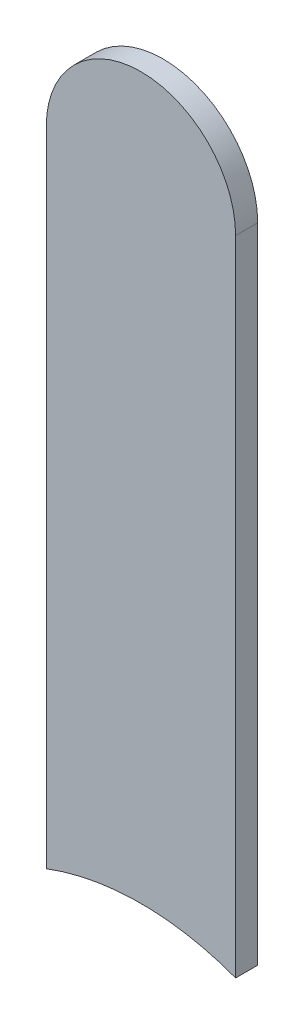
ISO-10303-21;
HEADER;
FILE_DESCRIPTION(('STEP AP214'),'2;1');
FILE_NAME('part.step','',(''),(''),'','','');
FILE_SCHEMA(('AUTOMOTIVE_DESIGN { 1 0 10303 214 1 1 1 1 }'));
ENDSEC;
DATA;
#1=APPLICATION_CONTEXT('core data for automotive mechanical design processes');
#2=APPLICATION_PROTOCOL_DEFINITION('international standard','automotive_design',2000,#1);
#3=PRODUCT_CONTEXT('',#1,'mechanical');
#4=PRODUCT('Part','Part','',(#3));
#5=PRODUCT_RELATED_PRODUCT_CATEGORY('part','',(#4));
#6=PRODUCT_DEFINITION_FORMATION('','',#4);
#7=PRODUCT_DEFINITION_CONTEXT('part definition',#1,'design');
#8=PRODUCT_DEFINITION('design','',#6,#7);
#9=PRODUCT_DEFINITION_SHAPE('','',#8);
#10=(LENGTH_UNIT() NAMED_UNIT(*) SI_UNIT(.MILLI.,.METRE.));
#11=(NAMED_UNIT(*) PLANE_ANGLE_UNIT() SI_UNIT($,.RADIAN.));
#12=(NAMED_UNIT(*) SI_UNIT($,.STERADIAN.) SOLID_ANGLE_UNIT());
#13=UNCERTAINTY_MEASURE_WITH_UNIT(LENGTH_MEASURE(1.E-05),#10,'distance_accuracy_value','');
#14=(GEOMETRIC_REPRESENTATION_CONTEXT(3) GLOBAL_UNCERTAINTY_ASSIGNED_CONTEXT((#13)) GLOBAL_UNIT_ASSIGNED_CONTEXT((#10,
#11,#12)) REPRESENTATION_CONTEXT('',''));
#15=CARTESIAN_POINT('',(0.,0.,0.));
#16=DIRECTION('',(0.,0.,1.));
#17=DIRECTION('',(1.,0.,0.));
#18=AXIS2_PLACEMENT_3D('',#15,#16,#17);
#19=CARTESIAN_POINT('',(117.2998,-71.2108,-0.035));
#20=DIRECTION('',(-1.,0.,0.));
#21=DIRECTION('',(0.,0.,1.));
#22=AXIS2_PLACEMENT_3D('',#19,#20,#21);
#23=PLANE('',#22);
#24=DIRECTION('',(0.,0.,1.));
#25=VECTOR('',#24,1.);
#26=CARTESIAN_POINT('',(117.2998,-69.7942,-0.035));
#27=LINE('',#26,#25);
#28=CARTESIAN_POINT('',(117.2998,-69.7942,-0.035));
#29=VERTEX_POINT('',#28);
#30=CARTESIAN_POINT('',(117.2998,-69.7942,0.));
#31=VERTEX_POINT('',#30);
#32=EDGE_CURVE('E11',#29,#31,#27,.T.);
#33=ORIENTED_EDGE('',*,*,#32,.T.);
#34=DIRECTION('',(0.,1.,0.));
#35=VECTOR('',#34,1.);
#36=CARTESIAN_POINT('',(117.2998,-71.2108,0.));
#37=LINE('',#36,#35);
#38=CARTESIAN_POINT('',(117.2998,-70.81315065699,0.));
#39=VERTEX_POINT('',#38);
#40=EDGE_CURVE('E21',#39,#31,#37,.T.);
#41=ORIENTED_EDGE('',*,*,#40,.F.);
#42=DIRECTION('',(0.,0.,-1.));
#43=VECTOR('',#42,1.);
#44=CARTESIAN_POINT('',(117.2998,-70.81315065698,-0.045));
#45=LINE('',#44,#43);
#46=CARTESIAN_POINT('',(117.2998,-70.81315065699,-0.035));
#47=VERTEX_POINT('',#46);
#48=EDGE_CURVE('E78',#39,#47,#45,.T.);
#49=ORIENTED_EDGE('',*,*,#48,.T.);
#50=DIRECTION('',(0.,1.,0.));
#51=VECTOR('',#50,1.);
#52=CARTESIAN_POINT('',(117.2998,-71.2108,-0.035));
#53=LINE('',#52,#51);
#54=EDGE_CURVE('E100',#47,#29,#53,.T.);
#55=ORIENTED_EDGE('',*,*,#54,.T.);
#56=EDGE_LOOP('',(#33,#41,#49,#55));
#57=FACE_BOUND('',#56,.T.);
#58=ADVANCED_FACE('F17',(#57),#23,.F.);
#59=CARTESIAN_POINT('',(117.1498,-69.7942,-0.035));
#60=DIRECTION('',(0.,0.,-1.));
#61=DIRECTION('',(1.,0.,0.));
#62=AXIS2_PLACEMENT_3D('',#59,#60,#61);
#63=CYLINDRICAL_SURFACE('',#62,0.15);
#64=CARTESIAN_POINT('',(117.1498,-69.7942,-0.035));
#65=DIRECTION('',(0.,0.,1.));
#66=DIRECTION('',(1.,0.,0.));
#67=AXIS2_PLACEMENT_3D('',#64,#65,#66);
#68=CIRCLE('',#67,0.15);
#69=CARTESIAN_POINT('',(116.9998,-69.7942,-0.035));
#70=VERTEX_POINT('',#69);
#71=EDGE_CURVE('E82',#29,#70,#68,.T.);
#72=ORIENTED_EDGE('',*,*,#71,.T.);
#73=DIRECTION('',(0.,0.,1.));
#74=VECTOR('',#73,1.);
#75=CARTESIAN_POINT('',(116.9998,-69.7942,-0.035));
#76=LINE('',#75,#74);
#77=CARTESIAN_POINT('',(116.9998,-69.7942,0.));
#78=VERTEX_POINT('',#77);
#79=EDGE_CURVE('E80',#70,#78,#76,.T.);
#80=ORIENTED_EDGE('',*,*,#79,.T.);
#81=CARTESIAN_POINT('',(117.1498,-69.7942,0.));
#82=DIRECTION('',(0.,0.,1.));
#83=DIRECTION('',(1.,0.,0.));
#84=AXIS2_PLACEMENT_3D('',#81,#82,#83);
#85=CIRCLE('',#84,0.15);
#86=EDGE_CURVE('E69',#31,#78,#85,.T.);
#87=ORIENTED_EDGE('',*,*,#86,.F.);
#88=ORIENTED_EDGE('',*,*,#32,.F.);
#89=EDGE_LOOP('',(#72,#80,#87,#88));
#90=FACE_BOUND('',#89,.T.);
#91=ADVANCED_FACE('F19',(#90),#63,.T.);
#92=CARTESIAN_POINT('',(116.9998,-69.7942,0.));
#93=DIRECTION('',(0.,0.,1.));
#94=DIRECTION('',(1.,0.,0.));
#95=AXIS2_PLACEMENT_3D('',#92,#93,#94);
#96=PLANE('',#95);
#97=ORIENTED_EDGE('',*,*,#86,.T.);
#98=DIRECTION('',(0.,-1.,0.));
#99=VECTOR('',#98,1.);
#100=CARTESIAN_POINT('',(116.9998,-69.7942,0.));
#101=LINE('',#100,#99);
#102=CARTESIAN_POINT('',(116.9998,-70.81315065698,0.));
#103=VERTEX_POINT('',#102);
#104=EDGE_CURVE('E74',#78,#103,#101,.T.);
#105=ORIENTED_EDGE('',*,*,#104,.T.);
#106=CARTESIAN_POINT('',(117.1498,-71.2108,0.));
#107=DIRECTION('',(0.,0.,-1.));
#108=DIRECTION('',(0.,-1.,0.));
#109=AXIS2_PLACEMENT_3D('',#106,#107,#108);
#110=CIRCLE('',#109,0.425);
#111=EDGE_CURVE('E111',#103,#39,#110,.T.);
#112=ORIENTED_EDGE('',*,*,#111,.T.);
#113=ORIENTED_EDGE('',*,*,#40,.T.);
#114=EDGE_LOOP('',(#97,#105,#112,#113));
#115=FACE_BOUND('',#114,.T.);
#116=ADVANCED_FACE('F71',(#115),#96,.T.);
#117=CARTESIAN_POINT('',(117.1498,-71.2108,-0.045));
#118=DIRECTION('',(0.,0.,-1.));
#119=DIRECTION('',(0.,-1.,0.));
#120=AXIS2_PLACEMENT_3D('',#117,#118,#119);
#121=CYLINDRICAL_SURFACE('',#120,0.425);
#122=ORIENTED_EDGE('',*,*,#111,.F.);
#123=DIRECTION('',(0.,0.,-1.));
#124=VECTOR('',#123,1.);
#125=CARTESIAN_POINT('',(116.9998,-70.81315065698,-0.045));
#126=LINE('',#125,#124);
#127=CARTESIAN_POINT('',(116.9998,-70.81315065698,-0.035));
#128=VERTEX_POINT('',#127);
#129=EDGE_CURVE('E91',#103,#128,#126,.T.);
#130=ORIENTED_EDGE('',*,*,#129,.T.);
#131=CARTESIAN_POINT('',(117.1498,-71.2108,-0.035));
#132=DIRECTION('',(0.,0.,-1.));
#133=DIRECTION('',(0.,-1.,0.));
#134=AXIS2_PLACEMENT_3D('',#131,#132,#133);
#135=CIRCLE('',#134,0.425);
#136=EDGE_CURVE('E103',#128,#47,#135,.T.);
#137=ORIENTED_EDGE('',*,*,#136,.T.);
#138=ORIENTED_EDGE('',*,*,#48,.F.);
#139=EDGE_LOOP('',(#122,#130,#137,#138));
#140=FACE_BOUND('',#139,.T.);
#141=ADVANCED_FACE('F119',(#140),#121,.F.);
#142=CARTESIAN_POINT('',(116.9998,-69.7942,-0.035));
#143=DIRECTION('',(0.,0.,1.));
#144=DIRECTION('',(1.,0.,0.));
#145=AXIS2_PLACEMENT_3D('',#142,#143,#144);
#146=PLANE('',#145);
#147=ORIENTED_EDGE('',*,*,#54,.F.);
#148=ORIENTED_EDGE('',*,*,#136,.F.);
#149=DIRECTION('',(0.,-1.,0.));
#150=VECTOR('',#149,1.);
#151=CARTESIAN_POINT('',(116.9998,-69.7942,-0.035));
#152=LINE('',#151,#150);
#153=EDGE_CURVE('E87',#70,#128,#152,.T.);
#154=ORIENTED_EDGE('',*,*,#153,.F.);
#155=ORIENTED_EDGE('',*,*,#71,.F.);
#156=EDGE_LOOP('',(#147,#148,#154,#155));
#157=FACE_BOUND('',#156,.T.);
#158=ADVANCED_FACE('F121',(#157),#146,.F.);
#159=CARTESIAN_POINT('',(116.9998,-69.7942,-0.035));
#160=DIRECTION('',(1.,0.,0.));
#161=DIRECTION('',(0.,1.,0.));
#162=AXIS2_PLACEMENT_3D('',#159,#160,#161);
#163=PLANE('',#162);
#164=ORIENTED_EDGE('',*,*,#129,.F.);
#165=ORIENTED_EDGE('',*,*,#104,.F.);
#166=ORIENTED_EDGE('',*,*,#79,.F.);
#167=ORIENTED_EDGE('',*,*,#153,.T.);
#168=EDGE_LOOP('',(#164,#165,#166,#167));
#169=FACE_BOUND('',#168,.T.);
#170=ADVANCED_FACE('F89',(#169),#163,.F.);
#171=CLOSED_SHELL('',(#58,#91,#116,#141,#158,#170));
#172=MANIFOLD_SOLID_BREP('B1',#171);
#173=ADVANCED_BREP_SHAPE_REPRESENTATION('',(#18,#172),#14);
#174=SHAPE_DEFINITION_REPRESENTATION(#9,#173);
ENDSEC;
END-ISO-10303-21;
